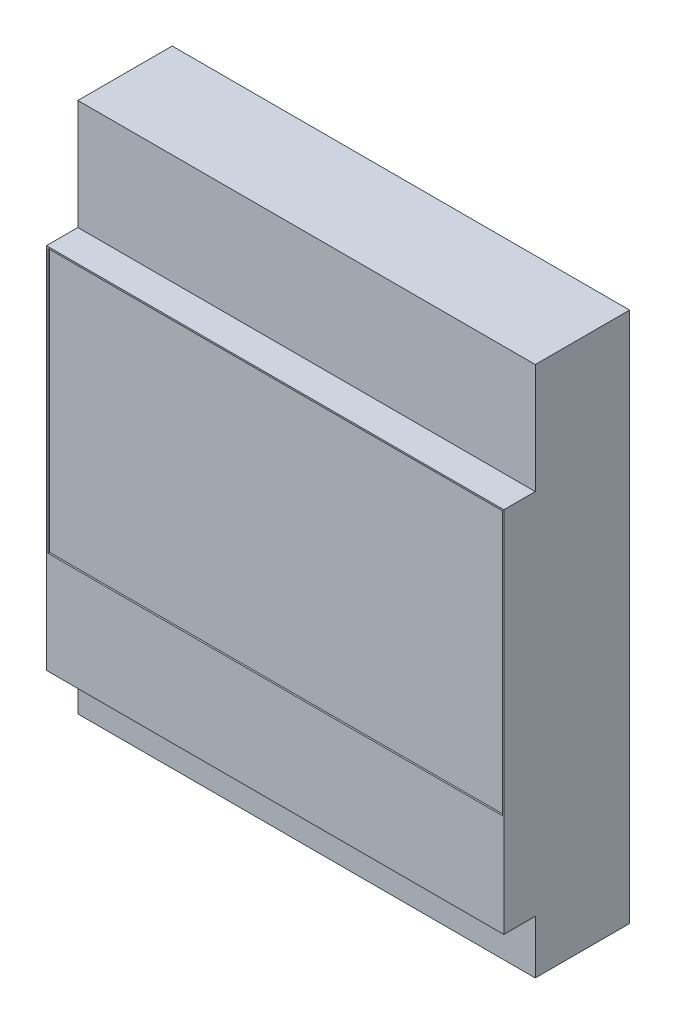
ISO-10303-21;
HEADER;
FILE_DESCRIPTION(('STEP AP214'),'2;1');
FILE_NAME('part.step','',(''),(''),'','','');
FILE_SCHEMA(('AUTOMOTIVE_DESIGN { 1 0 10303 214 1 1 1 1 }'));
ENDSEC;
DATA;
#1=APPLICATION_CONTEXT('core data for automotive mechanical design processes');
#2=APPLICATION_PROTOCOL_DEFINITION('international standard','automotive_design',2000,#1);
#3=PRODUCT_CONTEXT('',#1,'mechanical');
#4=PRODUCT('Part','Part','',(#3));
#5=PRODUCT_RELATED_PRODUCT_CATEGORY('part','',(#4));
#6=PRODUCT_DEFINITION_FORMATION('','',#4);
#7=PRODUCT_DEFINITION_CONTEXT('part definition',#1,'design');
#8=PRODUCT_DEFINITION('design','',#6,#7);
#9=PRODUCT_DEFINITION_SHAPE('','',#8);
#10=(LENGTH_UNIT() NAMED_UNIT(*) SI_UNIT(.MILLI.,.METRE.));
#11=(NAMED_UNIT(*) PLANE_ANGLE_UNIT() SI_UNIT($,.RADIAN.));
#12=(NAMED_UNIT(*) SI_UNIT($,.STERADIAN.) SOLID_ANGLE_UNIT());
#13=UNCERTAINTY_MEASURE_WITH_UNIT(LENGTH_MEASURE(1.E-05),#10,'distance_accuracy_value','');
#14=(GEOMETRIC_REPRESENTATION_CONTEXT(3) GLOBAL_UNCERTAINTY_ASSIGNED_CONTEXT((#13)) GLOBAL_UNIT_ASSIGNED_CONTEXT((#10,
#11,#12)) REPRESENTATION_CONTEXT('',''));
#15=CARTESIAN_POINT('',(0.,0.,0.));
#16=DIRECTION('',(0.,0.,1.));
#17=DIRECTION('',(1.,0.,0.));
#18=AXIS2_PLACEMENT_3D('',#15,#16,#17);
#19=CARTESIAN_POINT('',(7.275,-5.85,1.));
#20=DIRECTION('',(-1.,0.,0.));
#21=DIRECTION('',(0.,0.,1.));
#22=AXIS2_PLACEMENT_3D('',#19,#20,#21);
#23=PLANE('',#22);
#24=DIRECTION('',(0.,0.,-1.));
#25=VECTOR('',#24,1.);
#26=CARTESIAN_POINT('',(7.275,-5.85,1.));
#27=LINE('',#26,#25);
#28=CARTESIAN_POINT('',(7.275,-5.85,1.));
#29=VERTEX_POINT('',#28);
#30=CARTESIAN_POINT('',(7.275,-5.85,0.));
#31=VERTEX_POINT('',#30);
#32=EDGE_CURVE('E117',#29,#31,#27,.T.);
#33=ORIENTED_EDGE('',*,*,#32,.T.);
#34=DIRECTION('',(0.,-1.,0.));
#35=VECTOR('',#34,1.);
#36=CARTESIAN_POINT('',(7.275,9.35,0.));
#37=LINE('',#36,#35);
#38=CARTESIAN_POINT('',(7.275,-7.55,0.));
#39=VERTEX_POINT('',#38);
#40=EDGE_CURVE('E201',#31,#39,#37,.T.);
#41=ORIENTED_EDGE('',*,*,#40,.T.);
#42=DIRECTION('',(0.,0.,1.));
#43=VECTOR('',#42,1.);
#44=CARTESIAN_POINT('',(7.275,-7.55,-3.));
#45=LINE('',#44,#43);
#46=CARTESIAN_POINT('',(7.275,-7.55,-3.));
#47=VERTEX_POINT('',#46);
#48=EDGE_CURVE('E173',#47,#39,#45,.T.);
#49=ORIENTED_EDGE('',*,*,#48,.F.);
#50=DIRECTION('',(0.,-1.,0.));
#51=VECTOR('',#50,1.);
#52=CARTESIAN_POINT('',(7.275,9.35,-3.));
#53=LINE('',#52,#51);
#54=CARTESIAN_POINT('',(7.275,9.35,-3.));
#55=VERTEX_POINT('',#54);
#56=EDGE_CURVE('E239',#55,#47,#53,.T.);
#57=ORIENTED_EDGE('',*,*,#56,.F.);
#58=DIRECTION('',(0.,0.,1.));
#59=VECTOR('',#58,1.);
#60=CARTESIAN_POINT('',(7.275,9.35,-3.));
#61=LINE('',#60,#59);
#62=CARTESIAN_POINT('',(7.275,9.35,0.));
#63=VERTEX_POINT('',#62);
#64=EDGE_CURVE('E253',#55,#63,#61,.T.);
#65=ORIENTED_EDGE('',*,*,#64,.T.);
#66=CARTESIAN_POINT('',(7.275,5.85,0.));
#67=VERTEX_POINT('',#66);
#68=EDGE_CURVE('E206',#63,#67,#37,.T.);
#69=ORIENTED_EDGE('',*,*,#68,.T.);
#70=DIRECTION('',(0.,0.,-1.));
#71=VECTOR('',#70,1.);
#72=CARTESIAN_POINT('',(7.275,5.85,1.));
#73=LINE('',#72,#71);
#74=CARTESIAN_POINT('',(7.275,5.85,1.));
#75=VERTEX_POINT('',#74);
#76=EDGE_CURVE('E11',#75,#67,#73,.T.);
#77=ORIENTED_EDGE('',*,*,#76,.F.);
#78=DIRECTION('',(0.,1.,0.));
#79=VECTOR('',#78,1.);
#80=CARTESIAN_POINT('',(7.275,-5.85,1.));
#81=LINE('',#80,#79);
#82=EDGE_CURVE('E104',#29,#75,#81,.T.);
#83=ORIENTED_EDGE('',*,*,#82,.F.);
#84=EDGE_LOOP('',(#33,#41,#49,#57,#65,#69,#77,#83));
#85=FACE_BOUND('',#84,.T.);
#86=ADVANCED_FACE('F34',(#85),#23,.F.);
#87=CARTESIAN_POINT('',(-7.275,5.85,1.));
#88=DIRECTION('',(0.,-1.,0.));
#89=DIRECTION('',(0.,0.,-1.));
#90=AXIS2_PLACEMENT_3D('',#87,#88,#89);
#91=PLANE('',#90);
#92=DIRECTION('',(-1.,0.,0.));
#93=VECTOR('',#92,1.);
#94=CARTESIAN_POINT('',(-7.275,5.85,0.));
#95=LINE('',#94,#93);
#96=CARTESIAN_POINT('',(-7.275,5.85,0.));
#97=VERTEX_POINT('',#96);
#98=EDGE_CURVE('E110',#67,#97,#95,.T.);
#99=ORIENTED_EDGE('',*,*,#98,.T.);
#100=DIRECTION('',(0.,0.,-1.));
#101=VECTOR('',#100,1.);
#102=CARTESIAN_POINT('',(-7.275,5.85,1.));
#103=LINE('',#102,#101);
#104=CARTESIAN_POINT('',(-7.275,5.85,1.));
#105=VERTEX_POINT('',#104);
#106=EDGE_CURVE('E41',#105,#97,#103,.T.);
#107=ORIENTED_EDGE('',*,*,#106,.F.);
#108=DIRECTION('',(-1.,0.,0.));
#109=VECTOR('',#108,1.);
#110=CARTESIAN_POINT('',(-7.275,5.85,1.));
#111=LINE('',#110,#109);
#112=EDGE_CURVE('E97',#75,#105,#111,.T.);
#113=ORIENTED_EDGE('',*,*,#112,.F.);
#114=ORIENTED_EDGE('',*,*,#76,.T.);
#115=EDGE_LOOP('',(#99,#107,#113,#114));
#116=FACE_BOUND('',#115,.T.);
#117=ADVANCED_FACE('F109',(#116),#91,.F.);
#118=CARTESIAN_POINT('',(-7.275,-5.85,1.));
#119=DIRECTION('',(1.,0.,0.));
#120=DIRECTION('',(0.,0.,-1.));
#121=AXIS2_PLACEMENT_3D('',#118,#119,#120);
#122=PLANE('',#121);
#123=ORIENTED_EDGE('',*,*,#106,.T.);
#124=DIRECTION('',(0.,1.,0.));
#125=VECTOR('',#124,1.);
#126=CARTESIAN_POINT('',(-7.275,9.35,0.));
#127=LINE('',#126,#125);
#128=CARTESIAN_POINT('',(-7.275,9.35,0.));
#129=VERTEX_POINT('',#128);
#130=EDGE_CURVE('E70',#97,#129,#127,.T.);
#131=ORIENTED_EDGE('',*,*,#130,.T.);
#132=DIRECTION('',(0.,0.,1.));
#133=VECTOR('',#132,1.);
#134=CARTESIAN_POINT('',(-7.275,9.35,-3.));
#135=LINE('',#134,#133);
#136=CARTESIAN_POINT('',(-7.275,9.35,-3.));
#137=VERTEX_POINT('',#136);
#138=EDGE_CURVE('E248',#137,#129,#135,.T.);
#139=ORIENTED_EDGE('',*,*,#138,.F.);
#140=DIRECTION('',(0.,1.,0.));
#141=VECTOR('',#140,1.);
#142=CARTESIAN_POINT('',(-7.275,9.35,-3.));
#143=LINE('',#142,#141);
#144=CARTESIAN_POINT('',(-7.275,-7.55,-3.));
#145=VERTEX_POINT('',#144);
#146=EDGE_CURVE('E238',#145,#137,#143,.T.);
#147=ORIENTED_EDGE('',*,*,#146,.F.);
#148=DIRECTION('',(0.,0.,1.));
#149=VECTOR('',#148,1.);
#150=CARTESIAN_POINT('',(-7.275,-7.55,-3.));
#151=LINE('',#150,#149);
#152=CARTESIAN_POINT('',(-7.275,-7.55,0.));
#153=VERTEX_POINT('',#152);
#154=EDGE_CURVE('E235',#145,#153,#151,.T.);
#155=ORIENTED_EDGE('',*,*,#154,.T.);
#156=CARTESIAN_POINT('',(-7.275,-5.85,0.));
#157=VERTEX_POINT('',#156);
#158=EDGE_CURVE('E256',#153,#157,#127,.T.);
#159=ORIENTED_EDGE('',*,*,#158,.T.);
#160=DIRECTION('',(0.,0.,-1.));
#161=VECTOR('',#160,1.);
#162=CARTESIAN_POINT('',(-7.275,-5.85,1.));
#163=LINE('',#162,#161);
#164=CARTESIAN_POINT('',(-7.275,-5.85,1.));
#165=VERTEX_POINT('',#164);
#166=EDGE_CURVE('E112',#165,#157,#163,.T.);
#167=ORIENTED_EDGE('',*,*,#166,.F.);
#168=DIRECTION('',(0.,-1.,0.));
#169=VECTOR('',#168,1.);
#170=CARTESIAN_POINT('',(-7.275,-5.85,1.));
#171=LINE('',#170,#169);
#172=EDGE_CURVE('E101',#105,#165,#171,.T.);
#173=ORIENTED_EDGE('',*,*,#172,.F.);
#174=EDGE_LOOP('',(#123,#131,#139,#147,#155,#159,#167,#173));
#175=FACE_BOUND('',#174,.T.);
#176=ADVANCED_FACE('F113',(#175),#122,.F.);
#177=CARTESIAN_POINT('',(-7.275,-5.85,1.));
#178=DIRECTION('',(0.,1.,0.));
#179=DIRECTION('',(0.,0.,1.));
#180=AXIS2_PLACEMENT_3D('',#177,#178,#179);
#181=PLANE('',#180);
#182=DIRECTION('',(1.,0.,0.));
#183=VECTOR('',#182,1.);
#184=CARTESIAN_POINT('',(-7.275,-5.85,0.));
#185=LINE('',#184,#183);
#186=EDGE_CURVE('E122',#157,#31,#185,.T.);
#187=ORIENTED_EDGE('',*,*,#186,.T.);
#188=ORIENTED_EDGE('',*,*,#32,.F.);
#189=DIRECTION('',(1.,0.,0.));
#190=VECTOR('',#189,1.);
#191=CARTESIAN_POINT('',(-7.275,-5.85,1.));
#192=LINE('',#191,#190);
#193=EDGE_CURVE('E57',#165,#29,#192,.T.);
#194=ORIENTED_EDGE('',*,*,#193,.F.);
#195=ORIENTED_EDGE('',*,*,#166,.T.);
#196=EDGE_LOOP('',(#187,#188,#194,#195));
#197=FACE_BOUND('',#196,.T.);
#198=ADVANCED_FACE('F128',(#197),#181,.F.);
#199=CARTESIAN_POINT('',(0.,0.,1.));
#200=DIRECTION('',(0.,0.,-1.));
#201=DIRECTION('',(-1.,0.,0.));
#202=AXIS2_PLACEMENT_3D('',#199,#200,#201);
#203=PLANE('',#202);
#204=DIRECTION('',(1.,0.,0.));
#205=VECTOR('',#204,1.);
#206=CARTESIAN_POINT('',(-7.225,-2.6,1.));
#207=LINE('',#206,#205);
#208=CARTESIAN_POINT('',(-7.225,-2.6,1.));
#209=VERTEX_POINT('',#208);
#210=CARTESIAN_POINT('',(7.225,-2.6,1.));
#211=VERTEX_POINT('',#210);
#212=EDGE_CURVE('E150',#209,#211,#207,.T.);
#213=ORIENTED_EDGE('',*,*,#212,.F.);
#214=DIRECTION('',(0.,-1.,0.));
#215=VECTOR('',#214,1.);
#216=CARTESIAN_POINT('',(-7.225,5.8,1.));
#217=LINE('',#216,#215);
#218=CARTESIAN_POINT('',(-7.225,5.8,1.));
#219=VERTEX_POINT('',#218);
#220=EDGE_CURVE('E48',#219,#209,#217,.T.);
#221=ORIENTED_EDGE('',*,*,#220,.F.);
#222=DIRECTION('',(-1.,0.,0.));
#223=VECTOR('',#222,1.);
#224=CARTESIAN_POINT('',(-7.225,5.8,1.));
#225=LINE('',#224,#223);
#226=CARTESIAN_POINT('',(7.225,5.8,1.));
#227=VERTEX_POINT('',#226);
#228=EDGE_CURVE('E167',#227,#219,#225,.T.);
#229=ORIENTED_EDGE('',*,*,#228,.F.);
#230=DIRECTION('',(0.,1.,0.));
#231=VECTOR('',#230,1.);
#232=CARTESIAN_POINT('',(7.225,5.8,1.));
#233=LINE('',#232,#231);
#234=EDGE_CURVE('E175',#211,#227,#233,.T.);
#235=ORIENTED_EDGE('',*,*,#234,.F.);
#236=EDGE_LOOP('',(#213,#221,#229,#235));
#237=FACE_BOUND('',#236,.T.);
#238=ORIENTED_EDGE('',*,*,#82,.T.);
#239=ORIENTED_EDGE('',*,*,#112,.T.);
#240=ORIENTED_EDGE('',*,*,#172,.T.);
#241=ORIENTED_EDGE('',*,*,#193,.T.);
#242=EDGE_LOOP('',(#238,#239,#240,#241));
#243=FACE_BOUND('',#242,.T.);
#244=ADVANCED_FACE('F99',(#237,#243),#203,.F.);
#245=CARTESIAN_POINT('',(-7.225,5.8,0.95));
#246=DIRECTION('',(-1.,0.,0.));
#247=DIRECTION('',(0.,-1.,0.));
#248=AXIS2_PLACEMENT_3D('',#245,#246,#247);
#249=PLANE('',#248);
#250=ORIENTED_EDGE('',*,*,#220,.T.);
#251=DIRECTION('',(0.,0.,1.));
#252=VECTOR('',#251,1.);
#253=CARTESIAN_POINT('',(-7.225,-2.6,0.95));
#254=LINE('',#253,#252);
#255=CARTESIAN_POINT('',(-7.225,-2.6,0.95));
#256=VERTEX_POINT('',#255);
#257=EDGE_CURVE('E155',#256,#209,#254,.T.);
#258=ORIENTED_EDGE('',*,*,#257,.F.);
#259=DIRECTION('',(0.,-1.,0.));
#260=VECTOR('',#259,1.);
#261=CARTESIAN_POINT('',(-7.225,5.8,0.95));
#262=LINE('',#261,#260);
#263=CARTESIAN_POINT('',(-7.225,5.8,0.95));
#264=VERTEX_POINT('',#263);
#265=EDGE_CURVE('E165',#264,#256,#262,.T.);
#266=ORIENTED_EDGE('',*,*,#265,.F.);
#267=DIRECTION('',(0.,0.,1.));
#268=VECTOR('',#267,1.);
#269=CARTESIAN_POINT('',(-7.225,5.8,0.95));
#270=LINE('',#269,#268);
#271=EDGE_CURVE('E80',#264,#219,#270,.T.);
#272=ORIENTED_EDGE('',*,*,#271,.T.);
#273=EDGE_LOOP('',(#250,#258,#266,#272));
#274=FACE_BOUND('',#273,.T.);
#275=ADVANCED_FACE('F184',(#274),#249,.F.);
#276=CARTESIAN_POINT('',(-7.225,5.8,0.95));
#277=DIRECTION('',(0.,1.,0.));
#278=DIRECTION('',(0.,0.,1.));
#279=AXIS2_PLACEMENT_3D('',#276,#277,#278);
#280=PLANE('',#279);
#281=ORIENTED_EDGE('',*,*,#228,.T.);
#282=ORIENTED_EDGE('',*,*,#271,.F.);
#283=DIRECTION('',(-1.,0.,0.));
#284=VECTOR('',#283,1.);
#285=CARTESIAN_POINT('',(-7.225,5.8,0.95));
#286=LINE('',#285,#284);
#287=CARTESIAN_POINT('',(7.225,5.8,0.95));
#288=VERTEX_POINT('',#287);
#289=EDGE_CURVE('E162',#288,#264,#286,.T.);
#290=ORIENTED_EDGE('',*,*,#289,.F.);
#291=DIRECTION('',(0.,0.,1.));
#292=VECTOR('',#291,1.);
#293=CARTESIAN_POINT('',(7.225,5.8,0.95));
#294=LINE('',#293,#292);
#295=EDGE_CURVE('E154',#288,#227,#294,.T.);
#296=ORIENTED_EDGE('',*,*,#295,.T.);
#297=EDGE_LOOP('',(#281,#282,#290,#296));
#298=FACE_BOUND('',#297,.T.);
#299=ADVANCED_FACE('F182',(#298),#280,.F.);
#300=CARTESIAN_POINT('',(7.225,5.8,0.95));
#301=DIRECTION('',(1.,0.,0.));
#302=DIRECTION('',(0.,1.,0.));
#303=AXIS2_PLACEMENT_3D('',#300,#301,#302);
#304=PLANE('',#303);
#305=ORIENTED_EDGE('',*,*,#234,.T.);
#306=ORIENTED_EDGE('',*,*,#295,.F.);
#307=DIRECTION('',(0.,1.,0.));
#308=VECTOR('',#307,1.);
#309=CARTESIAN_POINT('',(7.225,5.8,0.95));
#310=LINE('',#309,#308);
#311=CARTESIAN_POINT('',(7.225,-2.6,0.95));
#312=VERTEX_POINT('',#311);
#313=EDGE_CURVE('E158',#312,#288,#310,.T.);
#314=ORIENTED_EDGE('',*,*,#313,.F.);
#315=DIRECTION('',(0.,0.,1.));
#316=VECTOR('',#315,1.);
#317=CARTESIAN_POINT('',(7.225,-2.6,0.95));
#318=LINE('',#317,#316);
#319=EDGE_CURVE('E143',#312,#211,#318,.T.);
#320=ORIENTED_EDGE('',*,*,#319,.T.);
#321=EDGE_LOOP('',(#305,#306,#314,#320));
#322=FACE_BOUND('',#321,.T.);
#323=ADVANCED_FACE('F159',(#322),#304,.F.);
#324=CARTESIAN_POINT('',(-7.225,-2.6,0.95));
#325=DIRECTION('',(0.,-1.,0.));
#326=DIRECTION('',(0.,0.,-1.));
#327=AXIS2_PLACEMENT_3D('',#324,#325,#326);
#328=PLANE('',#327);
#329=ORIENTED_EDGE('',*,*,#212,.T.);
#330=ORIENTED_EDGE('',*,*,#319,.F.);
#331=DIRECTION('',(1.,0.,0.));
#332=VECTOR('',#331,1.);
#333=CARTESIAN_POINT('',(-7.225,-2.6,0.95));
#334=LINE('',#333,#332);
#335=EDGE_CURVE('E147',#256,#312,#334,.T.);
#336=ORIENTED_EDGE('',*,*,#335,.F.);
#337=ORIENTED_EDGE('',*,*,#257,.T.);
#338=EDGE_LOOP('',(#329,#330,#336,#337));
#339=FACE_BOUND('',#338,.T.);
#340=ADVANCED_FACE('F145',(#339),#328,.F.);
#341=CARTESIAN_POINT('',(0.,0.,0.95));
#342=DIRECTION('',(0.,0.,1.));
#343=DIRECTION('',(1.,0.,0.));
#344=AXIS2_PLACEMENT_3D('',#341,#342,#343);
#345=PLANE('',#344);
#346=ORIENTED_EDGE('',*,*,#265,.T.);
#347=ORIENTED_EDGE('',*,*,#335,.T.);
#348=ORIENTED_EDGE('',*,*,#313,.T.);
#349=ORIENTED_EDGE('',*,*,#289,.T.);
#350=EDGE_LOOP('',(#346,#347,#348,#349));
#351=FACE_BOUND('',#350,.T.);
#352=ADVANCED_FACE('F164',(#351),#345,.T.);
#353=CARTESIAN_POINT('',(0.,0.,0.));
#354=DIRECTION('',(0.,0.,-1.));
#355=DIRECTION('',(-1.,0.,0.));
#356=AXIS2_PLACEMENT_3D('',#353,#354,#355);
#357=PLANE('',#356);
#358=ORIENTED_EDGE('',*,*,#186,.F.);
#359=ORIENTED_EDGE('',*,*,#158,.F.);
#360=DIRECTION('',(-1.,0.,0.));
#361=VECTOR('',#360,1.);
#362=CARTESIAN_POINT('',(7.275,-7.55,0.));
#363=LINE('',#362,#361);
#364=EDGE_CURVE('E258',#39,#153,#363,.T.);
#365=ORIENTED_EDGE('',*,*,#364,.F.);
#366=ORIENTED_EDGE('',*,*,#40,.F.);
#367=EDGE_LOOP('',(#358,#359,#365,#366));
#368=FACE_BOUND('',#367,.T.);
#369=ADVANCED_FACE('F268',(#368),#357,.F.);
#370=CARTESIAN_POINT('',(7.275,-7.55,-3.));
#371=DIRECTION('',(0.,1.,0.));
#372=DIRECTION('',(-1.,0.,0.));
#373=AXIS2_PLACEMENT_3D('',#370,#371,#372);
#374=PLANE('',#373);
#375=ORIENTED_EDGE('',*,*,#364,.T.);
#376=ORIENTED_EDGE('',*,*,#154,.F.);
#377=DIRECTION('',(-1.,0.,0.));
#378=VECTOR('',#377,1.);
#379=CARTESIAN_POINT('',(7.275,-7.55,-3.));
#380=LINE('',#379,#378);
#381=EDGE_CURVE('E231',#47,#145,#380,.T.);
#382=ORIENTED_EDGE('',*,*,#381,.F.);
#383=ORIENTED_EDGE('',*,*,#48,.T.);
#384=EDGE_LOOP('',(#375,#376,#382,#383));
#385=FACE_BOUND('',#384,.T.);
#386=ADVANCED_FACE('F233',(#385),#374,.F.);
#387=CARTESIAN_POINT('',(7.275,9.35,-3.));
#388=DIRECTION('',(0.,-1.,0.));
#389=DIRECTION('',(1.,0.,0.));
#390=AXIS2_PLACEMENT_3D('',#387,#388,#389);
#391=PLANE('',#390);
#392=DIRECTION('',(1.,0.,0.));
#393=VECTOR('',#392,1.);
#394=CARTESIAN_POINT('',(7.275,9.35,0.));
#395=LINE('',#394,#393);
#396=EDGE_CURVE('E246',#129,#63,#395,.T.);
#397=ORIENTED_EDGE('',*,*,#396,.T.);
#398=ORIENTED_EDGE('',*,*,#64,.F.);
#399=DIRECTION('',(1.,0.,0.));
#400=VECTOR('',#399,1.);
#401=CARTESIAN_POINT('',(7.275,9.35,-3.));
#402=LINE('',#401,#400);
#403=EDGE_CURVE('E244',#137,#55,#402,.T.);
#404=ORIENTED_EDGE('',*,*,#403,.F.);
#405=ORIENTED_EDGE('',*,*,#138,.T.);
#406=EDGE_LOOP('',(#397,#398,#404,#405));
#407=FACE_BOUND('',#406,.T.);
#408=ADVANCED_FACE('F264',(#407),#391,.F.);
#409=CARTESIAN_POINT('',(0.,0.,-3.));
#410=DIRECTION('',(0.,0.,-1.));
#411=DIRECTION('',(-1.,0.,0.));
#412=AXIS2_PLACEMENT_3D('',#409,#410,#411);
#413=PLANE('',#412);
#414=ORIENTED_EDGE('',*,*,#56,.T.);
#415=ORIENTED_EDGE('',*,*,#381,.T.);
#416=ORIENTED_EDGE('',*,*,#146,.T.);
#417=ORIENTED_EDGE('',*,*,#403,.T.);
#418=EDGE_LOOP('',(#414,#415,#416,#417));
#419=FACE_BOUND('',#418,.T.);
#420=ADVANCED_FACE('F242',(#419),#413,.T.);
#421=ORIENTED_EDGE('',*,*,#98,.F.);
#422=ORIENTED_EDGE('',*,*,#68,.F.);
#423=ORIENTED_EDGE('',*,*,#396,.F.);
#424=ORIENTED_EDGE('',*,*,#130,.F.);
#425=EDGE_LOOP('',(#421,#422,#423,#424));
#426=FACE_BOUND('',#425,.T.);
#427=ADVANCED_FACE('F265',(#426),#357,.F.);
#428=CLOSED_SHELL('',(#86,#117,#176,#198,#244,#275,#299,#323,#340,#352,#369,#386,#408,#420,#427));
#429=MANIFOLD_SOLID_BREP('B2',#428);
#430=ADVANCED_BREP_SHAPE_REPRESENTATION('',(#18,#429),#14);
#431=SHAPE_DEFINITION_REPRESENTATION(#9,#430);
ENDSEC;
END-ISO-10303-21;
